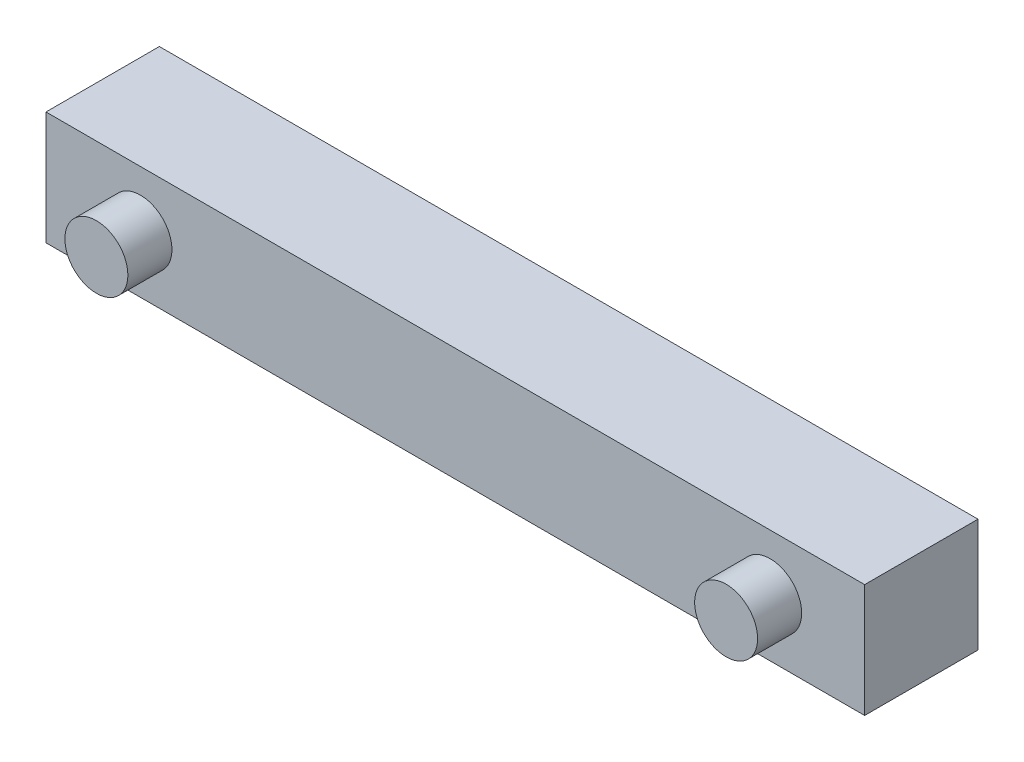
ISO-10303-21;
HEADER;
FILE_DESCRIPTION(('STEP AP214'),'2;1');
FILE_NAME('part.step','',(''),(''),'','','');
FILE_SCHEMA(('AUTOMOTIVE_DESIGN { 1 0 10303 214 1 1 1 1 }'));
ENDSEC;
DATA;
#1=APPLICATION_CONTEXT('core data for automotive mechanical design processes');
#2=APPLICATION_PROTOCOL_DEFINITION('international standard','automotive_design',2000,#1);
#3=PRODUCT_CONTEXT('',#1,'mechanical');
#4=PRODUCT('Part','Part','',(#3));
#5=PRODUCT_RELATED_PRODUCT_CATEGORY('part','',(#4));
#6=PRODUCT_DEFINITION_FORMATION('','',#4);
#7=PRODUCT_DEFINITION_CONTEXT('part definition',#1,'design');
#8=PRODUCT_DEFINITION('design','',#6,#7);
#9=PRODUCT_DEFINITION_SHAPE('','',#8);
#10=(LENGTH_UNIT() NAMED_UNIT(*) SI_UNIT(.MILLI.,.METRE.));
#11=(NAMED_UNIT(*) PLANE_ANGLE_UNIT() SI_UNIT($,.RADIAN.));
#12=(NAMED_UNIT(*) SI_UNIT($,.STERADIAN.) SOLID_ANGLE_UNIT());
#13=UNCERTAINTY_MEASURE_WITH_UNIT(LENGTH_MEASURE(1.E-05),#10,'distance_accuracy_value','');
#14=(GEOMETRIC_REPRESENTATION_CONTEXT(3) GLOBAL_UNCERTAINTY_ASSIGNED_CONTEXT((#13)) GLOBAL_UNIT_ASSIGNED_CONTEXT((#10,
#11,#12)) REPRESENTATION_CONTEXT('',''));
#15=CARTESIAN_POINT('',(0.,0.,0.));
#16=DIRECTION('',(0.,0.,1.));
#17=DIRECTION('',(1.,0.,0.));
#18=AXIS2_PLACEMENT_3D('',#15,#16,#17);
#19=CARTESIAN_POINT('',(0.,0.,9.));
#20=DIRECTION('',(0.,0.,-1.));
#21=DIRECTION('',(-1.,0.,0.));
#22=AXIS2_PLACEMENT_3D('',#19,#20,#21);
#23=PLANE('',#22);
#24=CARTESIAN_POINT('',(7.5,4.53014298375377,9.));
#25=DIRECTION('',(0.,0.,-1.));
#26=DIRECTION('',(-1.,0.,0.));
#27=AXIS2_PLACEMENT_3D('',#24,#25,#26);
#28=CIRCLE('',#27,2.5);
#29=CARTESIAN_POINT('',(5.,4.53014298375377,9.));
#30=VERTEX_POINT('',#29);
#31=EDGE_CURVE('E42',#30,#30,#28,.F.);
#32=ORIENTED_EDGE('',*,*,#31,.F.);
#33=EDGE_LOOP('',(#32));
#34=FACE_BOUND('',#33,.T.);
#35=DIRECTION('',(0.,-1.,0.));
#36=VECTOR('',#35,1.);
#37=CARTESIAN_POINT('',(0.,0.,9.));
#38=LINE('',#37,#36);
#39=CARTESIAN_POINT('',(0.,9.,9.));
#40=VERTEX_POINT('',#39);
#41=CARTESIAN_POINT('',(0.,0.,9.));
#42=VERTEX_POINT('',#41);
#43=EDGE_CURVE('E86',#40,#42,#38,.T.);
#44=ORIENTED_EDGE('',*,*,#43,.T.);
#45=DIRECTION('',(1.,0.,0.));
#46=VECTOR('',#45,1.);
#47=CARTESIAN_POINT('',(0.,0.,9.));
#48=LINE('',#47,#46);
#49=CARTESIAN_POINT('',(65.,0.,9.));
#50=VERTEX_POINT('',#49);
#51=EDGE_CURVE('E81',#42,#50,#48,.T.);
#52=ORIENTED_EDGE('',*,*,#51,.T.);
#53=DIRECTION('',(0.,1.,0.));
#54=VECTOR('',#53,1.);
#55=CARTESIAN_POINT('',(65.,0.,9.));
#56=LINE('',#55,#54);
#57=CARTESIAN_POINT('',(65.,9.,9.));
#58=VERTEX_POINT('',#57);
#59=EDGE_CURVE('E84',#50,#58,#56,.T.);
#60=ORIENTED_EDGE('',*,*,#59,.T.);
#61=DIRECTION('',(-1.,0.,0.));
#62=VECTOR('',#61,1.);
#63=CARTESIAN_POINT('',(0.,9.,9.));
#64=LINE('',#63,#62);
#65=EDGE_CURVE('E50',#58,#40,#64,.T.);
#66=ORIENTED_EDGE('',*,*,#65,.T.);
#67=EDGE_LOOP('',(#44,#52,#60,#66));
#68=FACE_BOUND('',#67,.T.);
#69=CARTESIAN_POINT('',(57.5,4.53014298375377,9.));
#70=DIRECTION('',(0.,0.,-1.));
#71=DIRECTION('',(-1.,0.,0.));
#72=AXIS2_PLACEMENT_3D('',#69,#70,#71);
#73=CIRCLE('',#72,2.5);
#74=CARTESIAN_POINT('',(55.,4.53014298375377,9.));
#75=VERTEX_POINT('',#74);
#76=EDGE_CURVE('E11',#75,#75,#73,.F.);
#77=ORIENTED_EDGE('',*,*,#76,.F.);
#78=EDGE_LOOP('',(#77));
#79=FACE_BOUND('',#78,.T.);
#80=ADVANCED_FACE('F33',(#34,#68,#79),#23,.F.);
#81=CARTESIAN_POINT('',(0.,0.,9.));
#82=DIRECTION('',(1.,0.,0.));
#83=DIRECTION('',(0.,0.,-1.));
#84=AXIS2_PLACEMENT_3D('',#81,#82,#83);
#85=PLANE('',#84);
#86=DIRECTION('',(0.,-1.,0.));
#87=VECTOR('',#86,1.);
#88=CARTESIAN_POINT('',(0.,0.,0.));
#89=LINE('',#88,#87);
#90=CARTESIAN_POINT('',(0.,9.,0.));
#91=VERTEX_POINT('',#90);
#92=CARTESIAN_POINT('',(0.,0.,0.));
#93=VERTEX_POINT('',#92);
#94=EDGE_CURVE('E101',#91,#93,#89,.T.);
#95=ORIENTED_EDGE('',*,*,#94,.T.);
#96=DIRECTION('',(0.,0.,-1.));
#97=VECTOR('',#96,1.);
#98=CARTESIAN_POINT('',(0.,0.,9.));
#99=LINE('',#98,#97);
#100=EDGE_CURVE('E92',#42,#93,#99,.T.);
#101=ORIENTED_EDGE('',*,*,#100,.F.);
#102=ORIENTED_EDGE('',*,*,#43,.F.);
#103=DIRECTION('',(0.,0.,-1.));
#104=VECTOR('',#103,1.);
#105=CARTESIAN_POINT('',(0.,9.,9.));
#106=LINE('',#105,#104);
#107=EDGE_CURVE('E97',#40,#91,#106,.T.);
#108=ORIENTED_EDGE('',*,*,#107,.T.);
#109=EDGE_LOOP('',(#95,#101,#102,#108));
#110=FACE_BOUND('',#109,.T.);
#111=ADVANCED_FACE('F35',(#110),#85,.F.);
#112=CARTESIAN_POINT('',(0.,0.,9.));
#113=DIRECTION('',(0.,1.,0.));
#114=DIRECTION('',(0.,0.,1.));
#115=AXIS2_PLACEMENT_3D('',#112,#113,#114);
#116=PLANE('',#115);
#117=DIRECTION('',(1.,0.,0.));
#118=VECTOR('',#117,1.);
#119=CARTESIAN_POINT('',(0.,0.,0.));
#120=LINE('',#119,#118);
#121=CARTESIAN_POINT('',(65.,0.,0.));
#122=VERTEX_POINT('',#121);
#123=EDGE_CURVE('E91',#93,#122,#120,.T.);
#124=ORIENTED_EDGE('',*,*,#123,.T.);
#125=DIRECTION('',(0.,0.,-1.));
#126=VECTOR('',#125,1.);
#127=CARTESIAN_POINT('',(65.,0.,9.));
#128=LINE('',#127,#126);
#129=EDGE_CURVE('E89',#50,#122,#128,.T.);
#130=ORIENTED_EDGE('',*,*,#129,.F.);
#131=ORIENTED_EDGE('',*,*,#51,.F.);
#132=ORIENTED_EDGE('',*,*,#100,.T.);
#133=EDGE_LOOP('',(#124,#130,#131,#132));
#134=FACE_BOUND('',#133,.T.);
#135=ADVANCED_FACE('F90',(#134),#116,.F.);
#136=CARTESIAN_POINT('',(65.,0.,9.));
#137=DIRECTION('',(-1.,0.,0.));
#138=DIRECTION('',(0.,0.,1.));
#139=AXIS2_PLACEMENT_3D('',#136,#137,#138);
#140=PLANE('',#139);
#141=DIRECTION('',(0.,1.,0.));
#142=VECTOR('',#141,1.);
#143=CARTESIAN_POINT('',(65.,0.,0.));
#144=LINE('',#143,#142);
#145=CARTESIAN_POINT('',(65.,9.,0.));
#146=VERTEX_POINT('',#145);
#147=EDGE_CURVE('E67',#122,#146,#144,.T.);
#148=ORIENTED_EDGE('',*,*,#147,.T.);
#149=DIRECTION('',(0.,0.,-1.));
#150=VECTOR('',#149,1.);
#151=CARTESIAN_POINT('',(65.,9.,9.));
#152=LINE('',#151,#150);
#153=EDGE_CURVE('E93',#58,#146,#152,.T.);
#154=ORIENTED_EDGE('',*,*,#153,.F.);
#155=ORIENTED_EDGE('',*,*,#59,.F.);
#156=ORIENTED_EDGE('',*,*,#129,.T.);
#157=EDGE_LOOP('',(#148,#154,#155,#156));
#158=FACE_BOUND('',#157,.T.);
#159=ADVANCED_FACE('F95',(#158),#140,.F.);
#160=CARTESIAN_POINT('',(0.,9.,9.));
#161=DIRECTION('',(0.,-1.,0.));
#162=DIRECTION('',(0.,0.,-1.));
#163=AXIS2_PLACEMENT_3D('',#160,#161,#162);
#164=PLANE('',#163);
#165=DIRECTION('',(-1.,0.,0.));
#166=VECTOR('',#165,1.);
#167=CARTESIAN_POINT('',(0.,9.,0.));
#168=LINE('',#167,#166);
#169=EDGE_CURVE('E73',#146,#91,#168,.T.);
#170=ORIENTED_EDGE('',*,*,#169,.T.);
#171=ORIENTED_EDGE('',*,*,#107,.F.);
#172=ORIENTED_EDGE('',*,*,#65,.F.);
#173=ORIENTED_EDGE('',*,*,#153,.T.);
#174=EDGE_LOOP('',(#170,#171,#172,#173));
#175=FACE_BOUND('',#174,.T.);
#176=ADVANCED_FACE('F127',(#175),#164,.F.);
#177=CARTESIAN_POINT('',(0.,0.,0.));
#178=DIRECTION('',(0.,0.,-1.));
#179=DIRECTION('',(-1.,0.,0.));
#180=AXIS2_PLACEMENT_3D('',#177,#178,#179);
#181=PLANE('',#180);
#182=ORIENTED_EDGE('',*,*,#94,.F.);
#183=ORIENTED_EDGE('',*,*,#169,.F.);
#184=ORIENTED_EDGE('',*,*,#147,.F.);
#185=ORIENTED_EDGE('',*,*,#123,.F.);
#186=EDGE_LOOP('',(#182,#183,#184,#185));
#187=FACE_BOUND('',#186,.T.);
#188=ADVANCED_FACE('F124',(#187),#181,.T.);
#189=CARTESIAN_POINT('',(7.5,4.53014298375377,12.5));
#190=DIRECTION('',(0.,0.,-1.));
#191=DIRECTION('',(-1.,0.,0.));
#192=AXIS2_PLACEMENT_3D('',#189,#190,#191);
#193=CYLINDRICAL_SURFACE('',#192,2.5);
#194=CARTESIAN_POINT('',(7.5,4.53014298375377,12.5));
#195=DIRECTION('',(0.,0.,1.));
#196=DIRECTION('',(1.,0.,0.));
#197=AXIS2_PLACEMENT_3D('',#194,#195,#196);
#198=CIRCLE('',#197,2.5);
#199=CARTESIAN_POINT('',(10.,4.53014298375377,12.5));
#200=VERTEX_POINT('',#199);
#201=EDGE_CURVE('E104',#200,#200,#198,.T.);
#202=ORIENTED_EDGE('',*,*,#201,.F.);
#203=EDGE_LOOP('',(#202));
#204=FACE_BOUND('',#203,.T.);
#205=ORIENTED_EDGE('',*,*,#31,.T.);
#206=EDGE_LOOP('',(#205));
#207=FACE_BOUND('',#206,.T.);
#208=ADVANCED_FACE('F113',(#204,#207),#193,.T.);
#209=CARTESIAN_POINT('',(7.5,4.53014298375377,12.5));
#210=DIRECTION('',(0.,0.,1.));
#211=DIRECTION('',(1.,0.,0.));
#212=AXIS2_PLACEMENT_3D('',#209,#210,#211);
#213=PLANE('',#212);
#214=ORIENTED_EDGE('',*,*,#201,.T.);
#215=EDGE_LOOP('',(#214));
#216=FACE_BOUND('',#215,.T.);
#217=ADVANCED_FACE('F155',(#216),#213,.T.);
#218=CARTESIAN_POINT('',(57.5,4.53014298375377,12.5));
#219=DIRECTION('',(0.,0.,-1.));
#220=DIRECTION('',(-1.,0.,0.));
#221=AXIS2_PLACEMENT_3D('',#218,#219,#220);
#222=CYLINDRICAL_SURFACE('',#221,2.5);
#223=CARTESIAN_POINT('',(57.5,4.53014298375377,12.5));
#224=DIRECTION('',(0.,0.,1.));
#225=DIRECTION('',(1.,0.,0.));
#226=AXIS2_PLACEMENT_3D('',#223,#224,#225);
#227=CIRCLE('',#226,2.5);
#228=CARTESIAN_POINT('',(60.,4.53014298375377,12.5));
#229=VERTEX_POINT('',#228);
#230=EDGE_CURVE('E206',#229,#229,#227,.T.);
#231=ORIENTED_EDGE('',*,*,#230,.F.);
#232=EDGE_LOOP('',(#231));
#233=FACE_BOUND('',#232,.T.);
#234=ORIENTED_EDGE('',*,*,#76,.T.);
#235=EDGE_LOOP('',(#234));
#236=FACE_BOUND('',#235,.T.);
#237=ADVANCED_FACE('F162',(#233,#236),#222,.T.);
#238=CARTESIAN_POINT('',(57.5,4.53014298375377,12.5));
#239=DIRECTION('',(0.,0.,1.));
#240=DIRECTION('',(1.,0.,0.));
#241=AXIS2_PLACEMENT_3D('',#238,#239,#240);
#242=PLANE('',#241);
#243=ORIENTED_EDGE('',*,*,#230,.T.);
#244=EDGE_LOOP('',(#243));
#245=FACE_BOUND('',#244,.T.);
#246=ADVANCED_FACE('F169',(#245),#242,.T.);
#247=CLOSED_SHELL('',(#80,#111,#135,#159,#176,#188,#208,#217,#237,#246));
#248=MANIFOLD_SOLID_BREP('B2',#247);
#249=ADVANCED_BREP_SHAPE_REPRESENTATION('',(#18,#248),#14);
#250=SHAPE_DEFINITION_REPRESENTATION(#9,#249);
ENDSEC;
END-ISO-10303-21;
